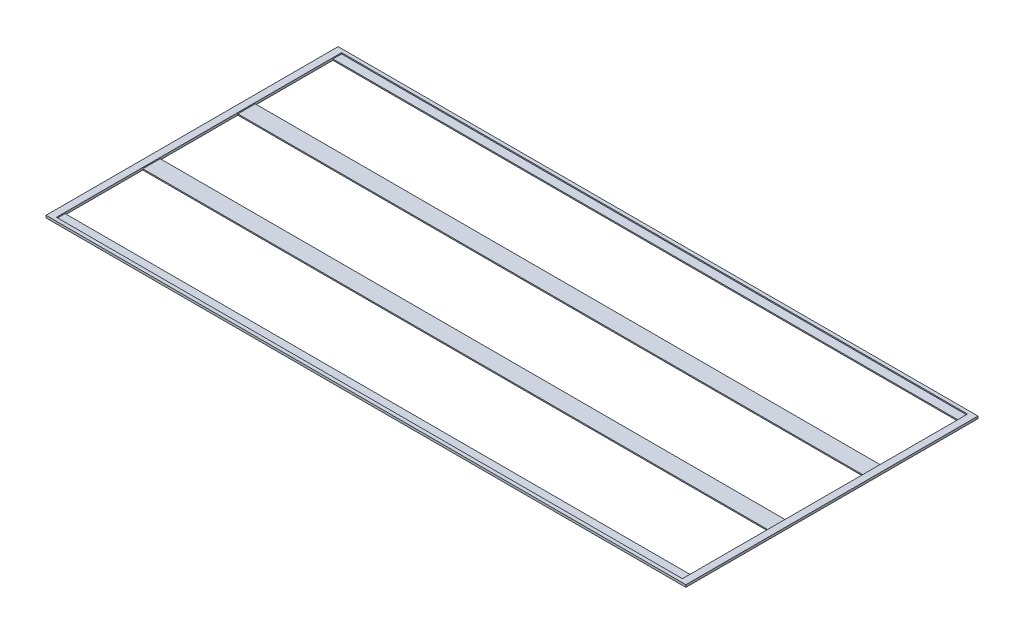
ISO-10303-21;
HEADER;
FILE_DESCRIPTION(('STEP AP214'),'2;1');
FILE_NAME('part.step','',(''),(''),'','','');
FILE_SCHEMA(('AUTOMOTIVE_DESIGN { 1 0 10303 214 1 1 1 1 }'));
ENDSEC;
DATA;
#1=APPLICATION_CONTEXT('core data for automotive mechanical design processes');
#2=APPLICATION_PROTOCOL_DEFINITION('international standard','automotive_design',2000,#1);
#3=PRODUCT_CONTEXT('',#1,'mechanical');
#4=PRODUCT('Part','Part','',(#3));
#5=PRODUCT_RELATED_PRODUCT_CATEGORY('part','',(#4));
#6=PRODUCT_DEFINITION_FORMATION('','',#4);
#7=PRODUCT_DEFINITION_CONTEXT('part definition',#1,'design');
#8=PRODUCT_DEFINITION('design','',#6,#7);
#9=PRODUCT_DEFINITION_SHAPE('','',#8);
#10=(LENGTH_UNIT() NAMED_UNIT(*) SI_UNIT(.MILLI.,.METRE.));
#11=(NAMED_UNIT(*) PLANE_ANGLE_UNIT() SI_UNIT($,.RADIAN.));
#12=(NAMED_UNIT(*) SI_UNIT($,.STERADIAN.) SOLID_ANGLE_UNIT());
#13=UNCERTAINTY_MEASURE_WITH_UNIT(LENGTH_MEASURE(1.E-05),#10,'distance_accuracy_value','');
#14=(GEOMETRIC_REPRESENTATION_CONTEXT(3) GLOBAL_UNCERTAINTY_ASSIGNED_CONTEXT((#13)) GLOBAL_UNIT_ASSIGNED_CONTEXT((#10,
#11,#12)) REPRESENTATION_CONTEXT('',''));
#15=CARTESIAN_POINT('',(0.,0.,0.));
#16=DIRECTION('',(0.,0.,1.));
#17=DIRECTION('',(1.,0.,0.));
#18=AXIS2_PLACEMENT_3D('',#15,#16,#17);
#19=CARTESIAN_POINT('',(0.,2.,0.));
#20=DIRECTION('',(0.,-1.,0.));
#21=DIRECTION('',(0.,0.,-1.));
#22=AXIS2_PLACEMENT_3D('',#19,#20,#21);
#23=PLANE('',#22);
#24=DIRECTION('',(0.,0.,-1.));
#25=VECTOR('',#24,1.);
#26=CARTESIAN_POINT('',(-540.,2.,246.));
#27=LINE('',#26,#25);
#28=CARTESIAN_POINT('',(-540.,2.,-67.0000000000001));
#29=VERTEX_POINT('',#28);
#30=CARTESIAN_POINT('',(-540.,2.,-97.));
#31=VERTEX_POINT('',#30);
#32=EDGE_CURVE('E232',#29,#31,#27,.T.);
#33=ORIENTED_EDGE('',*,*,#32,.F.);
#34=DIRECTION('',(-1.,0.,0.));
#35=VECTOR('',#34,1.);
#36=CARTESIAN_POINT('',(-540.,2.,-67.));
#37=LINE('',#36,#35);
#38=CARTESIAN_POINT('',(540.,2.,-67.));
#39=VERTEX_POINT('',#38);
#40=EDGE_CURVE('E81',#39,#29,#37,.T.);
#41=ORIENTED_EDGE('',*,*,#40,.F.);
#42=DIRECTION('',(0.,0.,-1.));
#43=VECTOR('',#42,1.);
#44=CARTESIAN_POINT('',(540.,2.,246.));
#45=LINE('',#44,#43);
#46=CARTESIAN_POINT('',(540.,2.,-97.));
#47=VERTEX_POINT('',#46);
#48=EDGE_CURVE('E376',#39,#47,#45,.T.);
#49=ORIENTED_EDGE('',*,*,#48,.T.);
#50=DIRECTION('',(1.,0.,0.));
#51=VECTOR('',#50,1.);
#52=CARTESIAN_POINT('',(540.,2.,-97.));
#53=LINE('',#52,#51);
#54=EDGE_CURVE('E325',#31,#47,#53,.T.);
#55=ORIENTED_EDGE('',*,*,#54,.F.);
#56=EDGE_LOOP('',(#33,#41,#49,#55));
#57=FACE_BOUND('',#56,.T.);
#58=ADVANCED_FACE('F65',(#57),#23,.F.);
#59=CARTESIAN_POINT('',(540.,2.,97.));
#60=VERTEX_POINT('',#59);
#61=CARTESIAN_POINT('',(540.,2.,67.));
#62=VERTEX_POINT('',#61);
#63=EDGE_CURVE('E224',#60,#62,#45,.T.);
#64=ORIENTED_EDGE('',*,*,#63,.T.);
#65=DIRECTION('',(1.,0.,0.));
#66=VECTOR('',#65,1.);
#67=CARTESIAN_POINT('',(540.,2.,67.));
#68=LINE('',#67,#66);
#69=CARTESIAN_POINT('',(-540.,2.,67.));
#70=VERTEX_POINT('',#69);
#71=EDGE_CURVE('E208',#70,#62,#68,.T.);
#72=ORIENTED_EDGE('',*,*,#71,.F.);
#73=CARTESIAN_POINT('',(-540.,2.,97.));
#74=VERTEX_POINT('',#73);
#75=EDGE_CURVE('E222',#74,#70,#27,.T.);
#76=ORIENTED_EDGE('',*,*,#75,.F.);
#77=DIRECTION('',(-1.,0.,0.));
#78=VECTOR('',#77,1.);
#79=CARTESIAN_POINT('',(-540.,2.,97.));
#80=LINE('',#79,#78);
#81=EDGE_CURVE('E89',#60,#74,#80,.T.);
#82=ORIENTED_EDGE('',*,*,#81,.F.);
#83=EDGE_LOOP('',(#64,#72,#76,#82));
#84=FACE_BOUND('',#83,.T.);
#85=ADVANCED_FACE('F221',(#84),#23,.F.);
#86=DIRECTION('',(-1.,0.,0.));
#87=VECTOR('',#86,1.);
#88=CARTESIAN_POINT('',(-540.,2.,-231.));
#89=LINE('',#88,#87);
#90=CARTESIAN_POINT('',(540.,2.,-231.));
#91=VERTEX_POINT('',#90);
#92=CARTESIAN_POINT('',(-540.,2.,-231.));
#93=VERTEX_POINT('',#92);
#94=EDGE_CURVE('E338',#91,#93,#89,.T.);
#95=ORIENTED_EDGE('',*,*,#94,.F.);
#96=CARTESIAN_POINT('',(540.,2.,-246.));
#97=VERTEX_POINT('',#96);
#98=EDGE_CURVE('E381',#91,#97,#45,.T.);
#99=ORIENTED_EDGE('',*,*,#98,.T.);
#100=DIRECTION('',(1.,0.,0.));
#101=VECTOR('',#100,1.);
#102=CARTESIAN_POINT('',(-540.,2.,-246.));
#103=LINE('',#102,#101);
#104=CARTESIAN_POINT('',(-540.,2.,-246.));
#105=VERTEX_POINT('',#104);
#106=EDGE_CURVE('E238',#105,#97,#103,.T.);
#107=ORIENTED_EDGE('',*,*,#106,.F.);
#108=EDGE_CURVE('E234',#93,#105,#27,.T.);
#109=ORIENTED_EDGE('',*,*,#108,.F.);
#110=EDGE_LOOP('',(#95,#99,#107,#109));
#111=FACE_BOUND('',#110,.T.);
#112=ADVANCED_FACE('F443',(#111),#23,.F.);
#113=CARTESIAN_POINT('',(540.,2.,246.));
#114=VERTEX_POINT('',#113);
#115=CARTESIAN_POINT('',(540.,2.,231.));
#116=VERTEX_POINT('',#115);
#117=EDGE_CURVE('E383',#114,#116,#45,.T.);
#118=ORIENTED_EDGE('',*,*,#117,.T.);
#119=DIRECTION('',(1.,0.,0.));
#120=VECTOR('',#119,1.);
#121=CARTESIAN_POINT('',(540.,2.,231.));
#122=LINE('',#121,#120);
#123=CARTESIAN_POINT('',(-540.,2.,231.));
#124=VERTEX_POINT('',#123);
#125=EDGE_CURVE('E346',#124,#116,#122,.T.);
#126=ORIENTED_EDGE('',*,*,#125,.F.);
#127=CARTESIAN_POINT('',(-540.,2.,246.));
#128=VERTEX_POINT('',#127);
#129=EDGE_CURVE('E231',#128,#124,#27,.T.);
#130=ORIENTED_EDGE('',*,*,#129,.F.);
#131=DIRECTION('',(1.,0.,0.));
#132=VECTOR('',#131,1.);
#133=CARTESIAN_POINT('',(-540.,2.,246.));
#134=LINE('',#133,#132);
#135=EDGE_CURVE('E389',#128,#114,#134,.T.);
#136=ORIENTED_EDGE('',*,*,#135,.T.);
#137=EDGE_LOOP('',(#118,#126,#130,#136));
#138=FACE_BOUND('',#137,.T.);
#139=ADVANCED_FACE('F463',(#138),#23,.F.);
#140=CARTESIAN_POINT('',(-540.,4.,246.));
#141=DIRECTION('',(0.,0.,-1.));
#142=DIRECTION('',(-1.,0.,0.));
#143=AXIS2_PLACEMENT_3D('',#140,#141,#142);
#144=PLANE('',#143);
#145=ORIENTED_EDGE('',*,*,#135,.F.);
#146=DIRECTION('',(0.,-1.,0.));
#147=VECTOR('',#146,1.);
#148=CARTESIAN_POINT('',(-540.,4.,246.));
#149=LINE('',#148,#147);
#150=CARTESIAN_POINT('',(-540.,4.,246.));
#151=VERTEX_POINT('',#150);
#152=EDGE_CURVE('E303',#151,#128,#149,.T.);
#153=ORIENTED_EDGE('',*,*,#152,.F.);
#154=DIRECTION('',(1.,0.,0.));
#155=VECTOR('',#154,1.);
#156=CARTESIAN_POINT('',(-540.,4.,246.));
#157=LINE('',#156,#155);
#158=CARTESIAN_POINT('',(540.,4.,246.));
#159=VERTEX_POINT('',#158);
#160=EDGE_CURVE('E317',#151,#159,#157,.T.);
#161=ORIENTED_EDGE('',*,*,#160,.T.);
#162=DIRECTION('',(0.,-1.,0.));
#163=VECTOR('',#162,1.);
#164=CARTESIAN_POINT('',(540.,4.,246.));
#165=LINE('',#164,#163);
#166=EDGE_CURVE('E278',#159,#114,#165,.T.);
#167=ORIENTED_EDGE('',*,*,#166,.T.);
#168=EDGE_LOOP('',(#145,#153,#161,#167));
#169=FACE_BOUND('',#168,.T.);
#170=ADVANCED_FACE('F456',(#169),#144,.T.);
#171=CARTESIAN_POINT('',(540.,4.,246.));
#172=DIRECTION('',(-1.,0.,0.));
#173=DIRECTION('',(0.,0.,1.));
#174=AXIS2_PLACEMENT_3D('',#171,#172,#173);
#175=PLANE('',#174);
#176=ORIENTED_EDGE('',*,*,#117,.F.);
#177=ORIENTED_EDGE('',*,*,#166,.F.);
#178=DIRECTION('',(0.,0.,-1.));
#179=VECTOR('',#178,1.);
#180=CARTESIAN_POINT('',(540.,4.,246.));
#181=LINE('',#180,#179);
#182=CARTESIAN_POINT('',(540.,4.,-246.));
#183=VERTEX_POINT('',#182);
#184=EDGE_CURVE('E314',#159,#183,#181,.T.);
#185=ORIENTED_EDGE('',*,*,#184,.T.);
#186=DIRECTION('',(0.,-1.,0.));
#187=VECTOR('',#186,1.);
#188=CARTESIAN_POINT('',(540.,4.,-246.));
#189=LINE('',#188,#187);
#190=EDGE_CURVE('E295',#183,#97,#189,.T.);
#191=ORIENTED_EDGE('',*,*,#190,.T.);
#192=ORIENTED_EDGE('',*,*,#98,.F.);
#193=DIRECTION('',(0.,1.,0.));
#194=VECTOR('',#193,1.);
#195=CARTESIAN_POINT('',(540.,-2.,-231.));
#196=LINE('',#195,#194);
#197=CARTESIAN_POINT('',(540.,0.,-231.));
#198=VERTEX_POINT('',#197);
#199=EDGE_CURVE('E320',#198,#91,#196,.T.);
#200=ORIENTED_EDGE('',*,*,#199,.F.);
#201=DIRECTION('',(0.,0.,1.));
#202=VECTOR('',#201,1.);
#203=CARTESIAN_POINT('',(540.,0.,0.));
#204=LINE('',#203,#202);
#205=CARTESIAN_POINT('',(540.,0.,-97.));
#206=VERTEX_POINT('',#205);
#207=EDGE_CURVE('E402',#198,#206,#204,.T.);
#208=ORIENTED_EDGE('',*,*,#207,.T.);
#209=DIRECTION('',(0.,1.,0.));
#210=VECTOR('',#209,1.);
#211=CARTESIAN_POINT('',(540.,-2.,-97.));
#212=LINE('',#211,#210);
#213=EDGE_CURVE('E329',#206,#47,#212,.T.);
#214=ORIENTED_EDGE('',*,*,#213,.T.);
#215=ORIENTED_EDGE('',*,*,#48,.F.);
#216=DIRECTION('',(0.,1.,0.));
#217=VECTOR('',#216,1.);
#218=CARTESIAN_POINT('',(540.,-2.,-67.));
#219=LINE('',#218,#217);
#220=CARTESIAN_POINT('',(540.,0.,-67.));
#221=VERTEX_POINT('',#220);
#222=EDGE_CURVE('E342',#221,#39,#219,.T.);
#223=ORIENTED_EDGE('',*,*,#222,.F.);
#224=DIRECTION('',(0.,0.,1.));
#225=VECTOR('',#224,1.);
#226=CARTESIAN_POINT('',(540.,0.,0.));
#227=LINE('',#226,#225);
#228=CARTESIAN_POINT('',(540.,0.,67.));
#229=VERTEX_POINT('',#228);
#230=EDGE_CURVE('E74',#221,#229,#227,.T.);
#231=ORIENTED_EDGE('',*,*,#230,.T.);
#232=DIRECTION('',(0.,1.,0.));
#233=VECTOR('',#232,1.);
#234=CARTESIAN_POINT('',(540.,-2.,67.));
#235=LINE('',#234,#233);
#236=EDGE_CURVE('E216',#229,#62,#235,.T.);
#237=ORIENTED_EDGE('',*,*,#236,.T.);
#238=ORIENTED_EDGE('',*,*,#63,.F.);
#239=DIRECTION('',(0.,1.,0.));
#240=VECTOR('',#239,1.);
#241=CARTESIAN_POINT('',(540.,-2.,97.));
#242=LINE('',#241,#240);
#243=CARTESIAN_POINT('',(540.,0.,97.));
#244=VERTEX_POINT('',#243);
#245=EDGE_CURVE('E352',#244,#60,#242,.T.);
#246=ORIENTED_EDGE('',*,*,#245,.F.);
#247=DIRECTION('',(0.,0.,1.));
#248=VECTOR('',#247,1.);
#249=CARTESIAN_POINT('',(540.,0.,0.));
#250=LINE('',#249,#248);
#251=CARTESIAN_POINT('',(540.,0.,231.));
#252=VERTEX_POINT('',#251);
#253=EDGE_CURVE('E415',#244,#252,#250,.T.);
#254=ORIENTED_EDGE('',*,*,#253,.T.);
#255=DIRECTION('',(0.,1.,0.));
#256=VECTOR('',#255,1.);
#257=CARTESIAN_POINT('',(540.,-2.,231.));
#258=LINE('',#257,#256);
#259=EDGE_CURVE('E349',#252,#116,#258,.T.);
#260=ORIENTED_EDGE('',*,*,#259,.T.);
#261=EDGE_LOOP('',(#176,#177,#185,#191,#192,#200,#208,#214,#215,#223,#231,#237,#238,#246,#254,#260));
#262=FACE_BOUND('',#261,.T.);
#263=ADVANCED_FACE('F378',(#262),#175,.T.);
#264=CARTESIAN_POINT('',(-540.,4.,-246.));
#265=DIRECTION('',(0.,0.,-1.));
#266=DIRECTION('',(-1.,0.,0.));
#267=AXIS2_PLACEMENT_3D('',#264,#265,#266);
#268=PLANE('',#267);
#269=DIRECTION('',(0.,-1.,0.));
#270=VECTOR('',#269,1.);
#271=CARTESIAN_POINT('',(-540.,4.,-246.));
#272=LINE('',#271,#270);
#273=CARTESIAN_POINT('',(-540.,4.,-246.));
#274=VERTEX_POINT('',#273);
#275=EDGE_CURVE('E299',#274,#105,#272,.T.);
#276=ORIENTED_EDGE('',*,*,#275,.T.);
#277=ORIENTED_EDGE('',*,*,#106,.T.);
#278=ORIENTED_EDGE('',*,*,#190,.F.);
#279=DIRECTION('',(1.,0.,0.));
#280=VECTOR('',#279,1.);
#281=CARTESIAN_POINT('',(-540.,4.,-246.));
#282=LINE('',#281,#280);
#283=EDGE_CURVE('E310',#274,#183,#282,.T.);
#284=ORIENTED_EDGE('',*,*,#283,.F.);
#285=EDGE_LOOP('',(#276,#277,#278,#284));
#286=FACE_BOUND('',#285,.T.);
#287=ADVANCED_FACE('F448',(#286),#268,.F.);
#288=CARTESIAN_POINT('',(-540.,4.,246.));
#289=DIRECTION('',(-1.,0.,0.));
#290=DIRECTION('',(0.,0.,1.));
#291=AXIS2_PLACEMENT_3D('',#288,#289,#290);
#292=PLANE('',#291);
#293=ORIENTED_EDGE('',*,*,#152,.T.);
#294=ORIENTED_EDGE('',*,*,#129,.T.);
#295=DIRECTION('',(0.,1.,0.));
#296=VECTOR('',#295,1.);
#297=CARTESIAN_POINT('',(-540.,-2.,231.));
#298=LINE('',#297,#296);
#299=CARTESIAN_POINT('',(-540.,0.,231.));
#300=VERTEX_POINT('',#299);
#301=EDGE_CURVE('E345',#300,#124,#298,.T.);
#302=ORIENTED_EDGE('',*,*,#301,.F.);
#303=DIRECTION('',(0.,0.,-1.));
#304=VECTOR('',#303,1.);
#305=CARTESIAN_POINT('',(-540.,0.,0.));
#306=LINE('',#305,#304);
#307=CARTESIAN_POINT('',(-540.,0.,97.));
#308=VERTEX_POINT('',#307);
#309=EDGE_CURVE('E408',#300,#308,#306,.T.);
#310=ORIENTED_EDGE('',*,*,#309,.T.);
#311=DIRECTION('',(0.,1.,0.));
#312=VECTOR('',#311,1.);
#313=CARTESIAN_POINT('',(-540.,-2.,97.));
#314=LINE('',#313,#312);
#315=EDGE_CURVE('E229',#308,#74,#314,.T.);
#316=ORIENTED_EDGE('',*,*,#315,.T.);
#317=ORIENTED_EDGE('',*,*,#75,.T.);
#318=DIRECTION('',(0.,1.,0.));
#319=VECTOR('',#318,1.);
#320=CARTESIAN_POINT('',(-540.,-2.,67.));
#321=LINE('',#320,#319);
#322=CARTESIAN_POINT('',(-540.,0.,67.));
#323=VERTEX_POINT('',#322);
#324=EDGE_CURVE('E204',#323,#70,#321,.T.);
#325=ORIENTED_EDGE('',*,*,#324,.F.);
#326=DIRECTION('',(0.,0.,-1.));
#327=VECTOR('',#326,1.);
#328=CARTESIAN_POINT('',(-540.,0.,0.));
#329=LINE('',#328,#327);
#330=CARTESIAN_POINT('',(-540.,0.,-67.));
#331=VERTEX_POINT('',#330);
#332=EDGE_CURVE('E421',#323,#331,#329,.T.);
#333=ORIENTED_EDGE('',*,*,#332,.T.);
#334=DIRECTION('',(0.,1.,0.));
#335=VECTOR('',#334,1.);
#336=CARTESIAN_POINT('',(-540.,-2.,-67.));
#337=LINE('',#336,#335);
#338=EDGE_CURVE('E217',#331,#29,#337,.T.);
#339=ORIENTED_EDGE('',*,*,#338,.T.);
#340=ORIENTED_EDGE('',*,*,#32,.T.);
#341=DIRECTION('',(0.,1.,0.));
#342=VECTOR('',#341,1.);
#343=CARTESIAN_POINT('',(-540.,-2.,-97.));
#344=LINE('',#343,#342);
#345=CARTESIAN_POINT('',(-540.,0.,-97.));
#346=VERTEX_POINT('',#345);
#347=EDGE_CURVE('E324',#346,#31,#344,.T.);
#348=ORIENTED_EDGE('',*,*,#347,.F.);
#349=DIRECTION('',(0.,0.,-1.));
#350=VECTOR('',#349,1.);
#351=CARTESIAN_POINT('',(-540.,0.,0.));
#352=LINE('',#351,#350);
#353=CARTESIAN_POINT('',(-540.,0.,-231.));
#354=VERTEX_POINT('',#353);
#355=EDGE_CURVE('E393',#346,#354,#352,.T.);
#356=ORIENTED_EDGE('',*,*,#355,.T.);
#357=DIRECTION('',(0.,1.,0.));
#358=VECTOR('',#357,1.);
#359=CARTESIAN_POINT('',(-540.,-2.,-231.));
#360=LINE('',#359,#358);
#361=EDGE_CURVE('E321',#354,#93,#360,.T.);
#362=ORIENTED_EDGE('',*,*,#361,.T.);
#363=ORIENTED_EDGE('',*,*,#108,.T.);
#364=ORIENTED_EDGE('',*,*,#275,.F.);
#365=DIRECTION('',(0.,0.,-1.));
#366=VECTOR('',#365,1.);
#367=CARTESIAN_POINT('',(-540.,4.,246.));
#368=LINE('',#367,#366);
#369=EDGE_CURVE('E306',#151,#274,#368,.T.);
#370=ORIENTED_EDGE('',*,*,#369,.F.);
#371=EDGE_LOOP('',(#293,#294,#302,#310,#316,#317,#325,#333,#339,#340,#348,#356,#362,#363,#364,#370));
#372=FACE_BOUND('',#371,.T.);
#373=ADVANCED_FACE('F228',(#372),#292,.F.);
#374=CARTESIAN_POINT('',(0.,4.,0.));
#375=DIRECTION('',(0.,1.,0.));
#376=DIRECTION('',(0.,0.,1.));
#377=AXIS2_PLACEMENT_3D('',#374,#375,#376);
#378=PLANE('',#377);
#379=DIRECTION('',(1.,0.,0.));
#380=VECTOR('',#379,1.);
#381=CARTESIAN_POINT('',(-552.000000000001,4.,252.006046605064));
#382=LINE('',#381,#380);
#383=CARTESIAN_POINT('',(-552.000000000001,4.,252.006046605064));
#384=VERTEX_POINT('',#383);
#385=CARTESIAN_POINT('',(551.999999999999,4.,252.006046605064));
#386=VERTEX_POINT('',#385);
#387=EDGE_CURVE('E267',#384,#386,#382,.T.);
#388=ORIENTED_EDGE('',*,*,#387,.T.);
#389=DIRECTION('',(0.,0.,-1.));
#390=VECTOR('',#389,1.);
#391=CARTESIAN_POINT('',(551.999999999999,4.,252.006046605064));
#392=LINE('',#391,#390);
#393=CARTESIAN_POINT('',(551.999999999999,4.,-252.006046605065));
#394=VERTEX_POINT('',#393);
#395=EDGE_CURVE('E286',#386,#394,#392,.T.);
#396=ORIENTED_EDGE('',*,*,#395,.T.);
#397=DIRECTION('',(1.,0.,0.));
#398=VECTOR('',#397,1.);
#399=CARTESIAN_POINT('',(-552.000000000001,4.,-252.006046605065));
#400=LINE('',#399,#398);
#401=CARTESIAN_POINT('',(-552.000000000001,4.,-252.006046605065));
#402=VERTEX_POINT('',#401);
#403=EDGE_CURVE('E282',#402,#394,#400,.T.);
#404=ORIENTED_EDGE('',*,*,#403,.F.);
#405=DIRECTION('',(0.,0.,-1.));
#406=VECTOR('',#405,1.);
#407=CARTESIAN_POINT('',(-552.000000000001,4.,252.006046605064));
#408=LINE('',#407,#406);
#409=EDGE_CURVE('E262',#384,#402,#408,.T.);
#410=ORIENTED_EDGE('',*,*,#409,.F.);
#411=EDGE_LOOP('',(#388,#396,#404,#410));
#412=FACE_BOUND('',#411,.T.);
#413=ORIENTED_EDGE('',*,*,#184,.F.);
#414=ORIENTED_EDGE('',*,*,#160,.F.);
#415=ORIENTED_EDGE('',*,*,#369,.T.);
#416=ORIENTED_EDGE('',*,*,#283,.T.);
#417=EDGE_LOOP('',(#413,#414,#415,#416));
#418=FACE_BOUND('',#417,.T.);
#419=ADVANCED_FACE('F453',(#412,#418),#378,.T.);
#420=CARTESIAN_POINT('',(-552.000000000001,4.,252.006046605064));
#421=DIRECTION('',(0.,0.,-1.));
#422=DIRECTION('',(-1.,0.,0.));
#423=AXIS2_PLACEMENT_3D('',#420,#421,#422);
#424=PLANE('',#423);
#425=DIRECTION('',(1.,0.,0.));
#426=VECTOR('',#425,1.);
#427=CARTESIAN_POINT('',(-552.000000000001,0.,252.006046605064));
#428=LINE('',#427,#426);
#429=CARTESIAN_POINT('',(-552.000000000001,0.,252.006046605064));
#430=VERTEX_POINT('',#429);
#431=CARTESIAN_POINT('',(551.999999999999,0.,252.006046605064));
#432=VERTEX_POINT('',#431);
#433=EDGE_CURVE('E275',#430,#432,#428,.T.);
#434=ORIENTED_EDGE('',*,*,#433,.T.);
#435=DIRECTION('',(0.,-1.,0.));
#436=VECTOR('',#435,1.);
#437=CARTESIAN_POINT('',(551.999999999999,4.,252.006046605064));
#438=LINE('',#437,#436);
#439=EDGE_CURVE('E242',#386,#432,#438,.T.);
#440=ORIENTED_EDGE('',*,*,#439,.F.);
#441=ORIENTED_EDGE('',*,*,#387,.F.);
#442=DIRECTION('',(0.,-1.,0.));
#443=VECTOR('',#442,1.);
#444=CARTESIAN_POINT('',(-552.000000000001,4.,252.006046605064));
#445=LINE('',#444,#443);
#446=EDGE_CURVE('E259',#384,#430,#445,.T.);
#447=ORIENTED_EDGE('',*,*,#446,.T.);
#448=EDGE_LOOP('',(#434,#440,#441,#447));
#449=FACE_BOUND('',#448,.T.);
#450=ADVANCED_FACE('F496',(#449),#424,.F.);
#451=CARTESIAN_POINT('',(551.999999999999,4.,252.006046605064));
#452=DIRECTION('',(-1.,0.,0.));
#453=DIRECTION('',(0.,0.,1.));
#454=AXIS2_PLACEMENT_3D('',#451,#452,#453);
#455=PLANE('',#454);
#456=DIRECTION('',(0.,0.,-1.));
#457=VECTOR('',#456,1.);
#458=CARTESIAN_POINT('',(551.999999999999,0.,252.006046605064));
#459=LINE('',#458,#457);
#460=CARTESIAN_POINT('',(551.999999999999,0.,-252.006046605065));
#461=VERTEX_POINT('',#460);
#462=EDGE_CURVE('E272',#432,#461,#459,.T.);
#463=ORIENTED_EDGE('',*,*,#462,.T.);
#464=DIRECTION('',(0.,-1.,0.));
#465=VECTOR('',#464,1.);
#466=CARTESIAN_POINT('',(551.999999999999,4.,-252.006046605065));
#467=LINE('',#466,#465);
#468=EDGE_CURVE('E248',#394,#461,#467,.T.);
#469=ORIENTED_EDGE('',*,*,#468,.F.);
#470=ORIENTED_EDGE('',*,*,#395,.F.);
#471=ORIENTED_EDGE('',*,*,#439,.T.);
#472=EDGE_LOOP('',(#463,#469,#470,#471));
#473=FACE_BOUND('',#472,.T.);
#474=ADVANCED_FACE('F505',(#473),#455,.F.);
#475=CARTESIAN_POINT('',(-552.000000000001,4.,-252.006046605065));
#476=DIRECTION('',(0.,0.,-1.));
#477=DIRECTION('',(-1.,0.,0.));
#478=AXIS2_PLACEMENT_3D('',#475,#476,#477);
#479=PLANE('',#478);
#480=DIRECTION('',(1.,0.,0.));
#481=VECTOR('',#480,1.);
#482=CARTESIAN_POINT('',(-552.000000000001,0.,-252.006046605065));
#483=LINE('',#482,#481);
#484=CARTESIAN_POINT('',(-552.000000000001,0.,-252.006046605065));
#485=VERTEX_POINT('',#484);
#486=EDGE_CURVE('E268',#485,#461,#483,.T.);
#487=ORIENTED_EDGE('',*,*,#486,.F.);
#488=DIRECTION('',(0.,-1.,0.));
#489=VECTOR('',#488,1.);
#490=CARTESIAN_POINT('',(-552.000000000001,4.,-252.006046605065));
#491=LINE('',#490,#489);
#492=EDGE_CURVE('E254',#402,#485,#491,.T.);
#493=ORIENTED_EDGE('',*,*,#492,.F.);
#494=ORIENTED_EDGE('',*,*,#403,.T.);
#495=ORIENTED_EDGE('',*,*,#468,.T.);
#496=EDGE_LOOP('',(#487,#493,#494,#495));
#497=FACE_BOUND('',#496,.T.);
#498=ADVANCED_FACE('F501',(#497),#479,.T.);
#499=CARTESIAN_POINT('',(-552.000000000001,4.,252.006046605064));
#500=DIRECTION('',(-1.,0.,0.));
#501=DIRECTION('',(0.,0.,1.));
#502=AXIS2_PLACEMENT_3D('',#499,#500,#501);
#503=PLANE('',#502);
#504=DIRECTION('',(0.,0.,-1.));
#505=VECTOR('',#504,1.);
#506=CARTESIAN_POINT('',(-552.000000000001,0.,252.006046605064));
#507=LINE('',#506,#505);
#508=EDGE_CURVE('E263',#430,#485,#507,.T.);
#509=ORIENTED_EDGE('',*,*,#508,.F.);
#510=ORIENTED_EDGE('',*,*,#446,.F.);
#511=ORIENTED_EDGE('',*,*,#409,.T.);
#512=ORIENTED_EDGE('',*,*,#492,.T.);
#513=EDGE_LOOP('',(#509,#510,#511,#512));
#514=FACE_BOUND('',#513,.T.);
#515=ADVANCED_FACE('F498',(#514),#503,.T.);
#516=CARTESIAN_POINT('',(0.,0.,0.));
#517=DIRECTION('',(0.,-1.,0.));
#518=DIRECTION('',(0.,0.,-1.));
#519=AXIS2_PLACEMENT_3D('',#516,#517,#518);
#520=PLANE('',#519);
#521=DIRECTION('',(1.,0.,0.));
#522=VECTOR('',#521,1.);
#523=CARTESIAN_POINT('',(0.,0.,-67.));
#524=LINE('',#523,#522);
#525=EDGE_CURVE('E12',#331,#221,#524,.T.);
#526=ORIENTED_EDGE('',*,*,#525,.F.);
#527=ORIENTED_EDGE('',*,*,#332,.F.);
#528=DIRECTION('',(-1.,0.,0.));
#529=VECTOR('',#528,1.);
#530=CARTESIAN_POINT('',(0.,0.,67.));
#531=LINE('',#530,#529);
#532=EDGE_CURVE('E211',#229,#323,#531,.T.);
#533=ORIENTED_EDGE('',*,*,#532,.F.);
#534=ORIENTED_EDGE('',*,*,#230,.F.);
#535=EDGE_LOOP('',(#526,#527,#533,#534));
#536=FACE_BOUND('',#535,.T.);
#537=DIRECTION('',(1.,0.,0.));
#538=VECTOR('',#537,1.);
#539=CARTESIAN_POINT('',(0.,0.,97.));
#540=LINE('',#539,#538);
#541=EDGE_CURVE('E418',#308,#244,#540,.T.);
#542=ORIENTED_EDGE('',*,*,#541,.F.);
#543=ORIENTED_EDGE('',*,*,#309,.F.);
#544=DIRECTION('',(-1.,0.,0.));
#545=VECTOR('',#544,1.);
#546=CARTESIAN_POINT('',(0.,0.,231.));
#547=LINE('',#546,#545);
#548=EDGE_CURVE('E411',#252,#300,#547,.T.);
#549=ORIENTED_EDGE('',*,*,#548,.F.);
#550=ORIENTED_EDGE('',*,*,#253,.F.);
#551=EDGE_LOOP('',(#542,#543,#549,#550));
#552=FACE_BOUND('',#551,.T.);
#553=DIRECTION('',(1.,0.,0.));
#554=VECTOR('',#553,1.);
#555=CARTESIAN_POINT('',(0.,0.,-231.));
#556=LINE('',#555,#554);
#557=EDGE_CURVE('E405',#354,#198,#556,.T.);
#558=ORIENTED_EDGE('',*,*,#557,.F.);
#559=ORIENTED_EDGE('',*,*,#355,.F.);
#560=DIRECTION('',(-1.,0.,0.));
#561=VECTOR('',#560,1.);
#562=CARTESIAN_POINT('',(0.,0.,-97.));
#563=LINE('',#562,#561);
#564=EDGE_CURVE('E396',#206,#346,#563,.T.);
#565=ORIENTED_EDGE('',*,*,#564,.F.);
#566=ORIENTED_EDGE('',*,*,#207,.F.);
#567=EDGE_LOOP('',(#558,#559,#565,#566));
#568=FACE_BOUND('',#567,.T.);
#569=ORIENTED_EDGE('',*,*,#433,.F.);
#570=ORIENTED_EDGE('',*,*,#508,.T.);
#571=ORIENTED_EDGE('',*,*,#486,.T.);
#572=ORIENTED_EDGE('',*,*,#462,.F.);
#573=EDGE_LOOP('',(#569,#570,#571,#572));
#574=FACE_BOUND('',#573,.T.);
#575=ADVANCED_FACE('F67',(#536,#552,#568,#574),#520,.T.);
#576=CARTESIAN_POINT('',(-540.,-2.,-231.));
#577=DIRECTION('',(0.,0.,-1.));
#578=DIRECTION('',(-1.,0.,0.));
#579=AXIS2_PLACEMENT_3D('',#576,#577,#578);
#580=PLANE('',#579);
#581=ORIENTED_EDGE('',*,*,#557,.T.);
#582=ORIENTED_EDGE('',*,*,#199,.T.);
#583=ORIENTED_EDGE('',*,*,#94,.T.);
#584=ORIENTED_EDGE('',*,*,#361,.F.);
#585=EDGE_LOOP('',(#581,#582,#583,#584));
#586=FACE_BOUND('',#585,.T.);
#587=ADVANCED_FACE('F438',(#586),#580,.F.);
#588=CARTESIAN_POINT('',(540.,-2.,-97.));
#589=DIRECTION('',(0.,0.,1.));
#590=DIRECTION('',(1.,0.,0.));
#591=AXIS2_PLACEMENT_3D('',#588,#589,#590);
#592=PLANE('',#591);
#593=ORIENTED_EDGE('',*,*,#564,.T.);
#594=ORIENTED_EDGE('',*,*,#347,.T.);
#595=ORIENTED_EDGE('',*,*,#54,.T.);
#596=ORIENTED_EDGE('',*,*,#213,.F.);
#597=EDGE_LOOP('',(#593,#594,#595,#596));
#598=FACE_BOUND('',#597,.T.);
#599=ADVANCED_FACE('F429',(#598),#592,.F.);
#600=CARTESIAN_POINT('',(-540.,-2.,97.));
#601=DIRECTION('',(0.,0.,-1.));
#602=DIRECTION('',(-1.,0.,0.));
#603=AXIS2_PLACEMENT_3D('',#600,#601,#602);
#604=PLANE('',#603);
#605=ORIENTED_EDGE('',*,*,#541,.T.);
#606=ORIENTED_EDGE('',*,*,#245,.T.);
#607=ORIENTED_EDGE('',*,*,#81,.T.);
#608=ORIENTED_EDGE('',*,*,#315,.F.);
#609=EDGE_LOOP('',(#605,#606,#607,#608));
#610=FACE_BOUND('',#609,.T.);
#611=ADVANCED_FACE('F466',(#610),#604,.F.);
#612=CARTESIAN_POINT('',(540.,-2.,231.));
#613=DIRECTION('',(0.,0.,1.));
#614=DIRECTION('',(1.,0.,0.));
#615=AXIS2_PLACEMENT_3D('',#612,#613,#614);
#616=PLANE('',#615);
#617=ORIENTED_EDGE('',*,*,#548,.T.);
#618=ORIENTED_EDGE('',*,*,#301,.T.);
#619=ORIENTED_EDGE('',*,*,#125,.T.);
#620=ORIENTED_EDGE('',*,*,#259,.F.);
#621=EDGE_LOOP('',(#617,#618,#619,#620));
#622=FACE_BOUND('',#621,.T.);
#623=ADVANCED_FACE('F462',(#622),#616,.F.);
#624=CARTESIAN_POINT('',(-540.,-2.,-67.));
#625=DIRECTION('',(0.,0.,-1.));
#626=DIRECTION('',(-1.,0.,0.));
#627=AXIS2_PLACEMENT_3D('',#624,#625,#626);
#628=PLANE('',#627);
#629=ORIENTED_EDGE('',*,*,#525,.T.);
#630=ORIENTED_EDGE('',*,*,#222,.T.);
#631=ORIENTED_EDGE('',*,*,#40,.T.);
#632=ORIENTED_EDGE('',*,*,#338,.F.);
#633=EDGE_LOOP('',(#629,#630,#631,#632));
#634=FACE_BOUND('',#633,.T.);
#635=ADVANCED_FACE('F368',(#634),#628,.F.);
#636=CARTESIAN_POINT('',(540.,-2.,67.));
#637=DIRECTION('',(0.,0.,1.));
#638=DIRECTION('',(1.,0.,0.));
#639=AXIS2_PLACEMENT_3D('',#636,#637,#638);
#640=PLANE('',#639);
#641=ORIENTED_EDGE('',*,*,#532,.T.);
#642=ORIENTED_EDGE('',*,*,#324,.T.);
#643=ORIENTED_EDGE('',*,*,#71,.T.);
#644=ORIENTED_EDGE('',*,*,#236,.F.);
#645=EDGE_LOOP('',(#641,#642,#643,#644));
#646=FACE_BOUND('',#645,.T.);
#647=ADVANCED_FACE('F206',(#646),#640,.F.);
#648=CLOSED_SHELL('',(#58,#85,#112,#139,#170,#263,#287,#373,#419,#450,#474,#498,#515,#575,#587,
#599,#611,#623,#635,#647));
#649=MANIFOLD_SOLID_BREP('B2',#648);
#650=ADVANCED_BREP_SHAPE_REPRESENTATION('',(#18,#649),#14);
#651=SHAPE_DEFINITION_REPRESENTATION(#9,#650);
ENDSEC;
END-ISO-10303-21;
